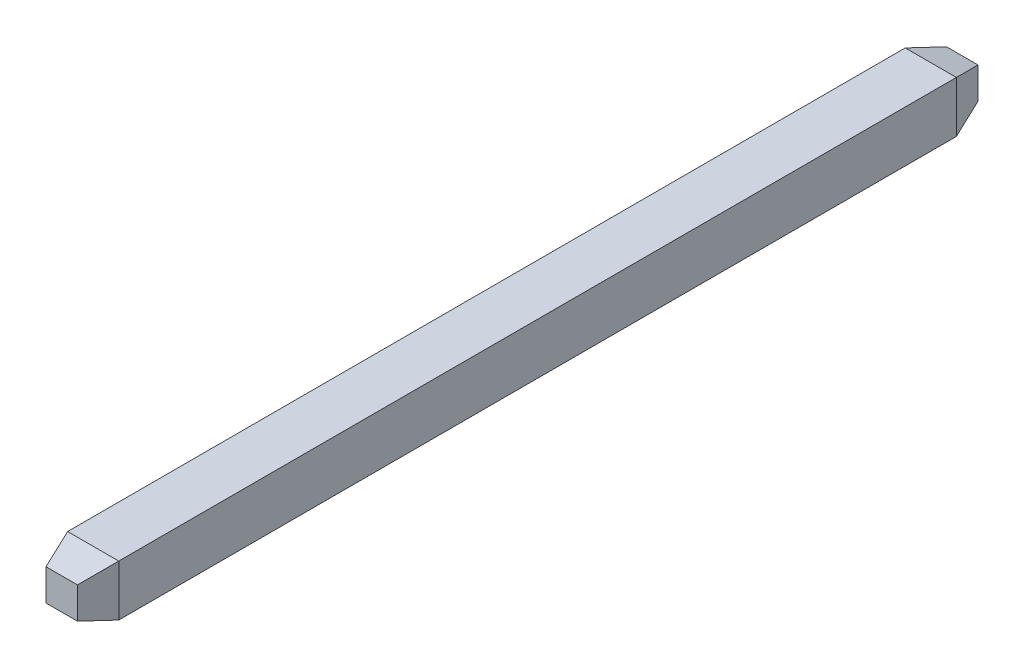
ISO-10303-21;
HEADER;
FILE_DESCRIPTION(('STEP AP214'),'2;1');
FILE_NAME('part.step','',(''),(''),'','','');
FILE_SCHEMA(('AUTOMOTIVE_DESIGN { 1 0 10303 214 1 1 1 1 }'));
ENDSEC;
DATA;
#1=APPLICATION_CONTEXT('core data for automotive mechanical design processes');
#2=APPLICATION_PROTOCOL_DEFINITION('international standard','automotive_design',2000,#1);
#3=PRODUCT_CONTEXT('',#1,'mechanical');
#4=PRODUCT('Part','Part','',(#3));
#5=PRODUCT_RELATED_PRODUCT_CATEGORY('part','',(#4));
#6=PRODUCT_DEFINITION_FORMATION('','',#4);
#7=PRODUCT_DEFINITION_CONTEXT('part definition',#1,'design');
#8=PRODUCT_DEFINITION('design','',#6,#7);
#9=PRODUCT_DEFINITION_SHAPE('','',#8);
#10=(LENGTH_UNIT() NAMED_UNIT(*) SI_UNIT(.MILLI.,.METRE.));
#11=(NAMED_UNIT(*) PLANE_ANGLE_UNIT() SI_UNIT($,.RADIAN.));
#12=(NAMED_UNIT(*) SI_UNIT($,.STERADIAN.) SOLID_ANGLE_UNIT());
#13=UNCERTAINTY_MEASURE_WITH_UNIT(LENGTH_MEASURE(1.E-05),#10,'distance_accuracy_value','');
#14=(GEOMETRIC_REPRESENTATION_CONTEXT(3) GLOBAL_UNCERTAINTY_ASSIGNED_CONTEXT((#13)) GLOBAL_UNIT_ASSIGNED_CONTEXT((#10,
#11,#12)) REPRESENTATION_CONTEXT('',''));
#15=CARTESIAN_POINT('',(0.,0.,0.));
#16=DIRECTION('',(0.,0.,1.));
#17=DIRECTION('',(1.,0.,0.));
#18=AXIS2_PLACEMENT_3D('',#15,#16,#17);
#19=CARTESIAN_POINT('',(0.325,-0.325,-5.45));
#20=DIRECTION('',(1.,0.,0.));
#21=DIRECTION('',(0.,0.,-1.));
#22=AXIS2_PLACEMENT_3D('',#19,#20,#21);
#23=PLANE('',#22);
#24=DIRECTION('',(0.,0.,1.));
#25=VECTOR('',#24,1.);
#26=CARTESIAN_POINT('',(0.325,-0.325,-5.45));
#27=LINE('',#26,#25);
#28=CARTESIAN_POINT('',(0.325,-0.325,-5.04999999999999));
#29=VERTEX_POINT('',#28);
#30=CARTESIAN_POINT('',(0.325,-0.325,5.6));
#31=VERTEX_POINT('',#30);
#32=EDGE_CURVE('E118',#29,#31,#27,.T.);
#33=ORIENTED_EDGE('',*,*,#32,.F.);
#34=DIRECTION('',(0.,1.,0.));
#35=VECTOR('',#34,1.);
#36=CARTESIAN_POINT('',(0.325,-0.325,-5.04999999999999));
#37=LINE('',#36,#35);
#38=CARTESIAN_POINT('',(0.325,0.325,-5.04999999999999));
#39=VERTEX_POINT('',#38);
#40=EDGE_CURVE('E11',#29,#39,#37,.T.);
#41=ORIENTED_EDGE('',*,*,#40,.T.);
#42=DIRECTION('',(0.,0.,1.));
#43=VECTOR('',#42,1.);
#44=CARTESIAN_POINT('',(0.325,0.325,-5.45));
#45=LINE('',#44,#43);
#46=CARTESIAN_POINT('',(0.325,0.325,5.6));
#47=VERTEX_POINT('',#46);
#48=EDGE_CURVE('E144',#39,#47,#45,.T.);
#49=ORIENTED_EDGE('',*,*,#48,.T.);
#50=DIRECTION('',(0.,-1.,0.));
#51=VECTOR('',#50,1.);
#52=CARTESIAN_POINT('',(0.325,-0.325,5.6));
#53=LINE('',#52,#51);
#54=EDGE_CURVE('E132',#47,#31,#53,.T.);
#55=ORIENTED_EDGE('',*,*,#54,.T.);
#56=EDGE_LOOP('',(#33,#41,#49,#55));
#57=FACE_BOUND('',#56,.T.);
#58=ADVANCED_FACE('F32',(#57),#23,.T.);
#59=CARTESIAN_POINT('',(-0.325,-0.325,-5.45));
#60=DIRECTION('',(0.,-1.,0.));
#61=DIRECTION('',(0.,0.,-1.));
#62=AXIS2_PLACEMENT_3D('',#59,#60,#61);
#63=PLANE('',#62);
#64=DIRECTION('',(0.,0.,1.));
#65=VECTOR('',#64,1.);
#66=CARTESIAN_POINT('',(-0.325,-0.325,-5.45));
#67=LINE('',#66,#65);
#68=CARTESIAN_POINT('',(-0.325,-0.325,-5.04999999999999));
#69=VERTEX_POINT('',#68);
#70=CARTESIAN_POINT('',(-0.325,-0.325,5.6));
#71=VERTEX_POINT('',#70);
#72=EDGE_CURVE('E187',#69,#71,#67,.T.);
#73=ORIENTED_EDGE('',*,*,#72,.F.);
#74=DIRECTION('',(1.,0.,0.));
#75=VECTOR('',#74,1.);
#76=CARTESIAN_POINT('',(-0.325,-0.325,-5.04999999999999));
#77=LINE('',#76,#75);
#78=EDGE_CURVE('E137',#69,#29,#77,.T.);
#79=ORIENTED_EDGE('',*,*,#78,.T.);
#80=ORIENTED_EDGE('',*,*,#32,.T.);
#81=DIRECTION('',(-1.,0.,0.));
#82=VECTOR('',#81,1.);
#83=CARTESIAN_POINT('',(-0.325,-0.325,5.6));
#84=LINE('',#83,#82);
#85=EDGE_CURVE('E135',#31,#71,#84,.T.);
#86=ORIENTED_EDGE('',*,*,#85,.T.);
#87=EDGE_LOOP('',(#73,#79,#80,#86));
#88=FACE_BOUND('',#87,.T.);
#89=ADVANCED_FACE('F186',(#88),#63,.T.);
#90=CARTESIAN_POINT('',(-0.325,-0.325,-5.45));
#91=DIRECTION('',(-1.,0.,0.));
#92=DIRECTION('',(0.,0.,1.));
#93=AXIS2_PLACEMENT_3D('',#90,#91,#92);
#94=PLANE('',#93);
#95=DIRECTION('',(0.,0.,1.));
#96=VECTOR('',#95,1.);
#97=CARTESIAN_POINT('',(-0.325,0.325,-5.45));
#98=LINE('',#97,#96);
#99=CARTESIAN_POINT('',(-0.325,0.325,-5.04999999999999));
#100=VERTEX_POINT('',#99);
#101=CARTESIAN_POINT('',(-0.325,0.325,5.6));
#102=VERTEX_POINT('',#101);
#103=EDGE_CURVE('E190',#100,#102,#98,.T.);
#104=ORIENTED_EDGE('',*,*,#103,.F.);
#105=DIRECTION('',(0.,-1.,0.));
#106=VECTOR('',#105,1.);
#107=CARTESIAN_POINT('',(-0.325,-0.325,-5.04999999999999));
#108=LINE('',#107,#106);
#109=EDGE_CURVE('E156',#100,#69,#108,.T.);
#110=ORIENTED_EDGE('',*,*,#109,.T.);
#111=ORIENTED_EDGE('',*,*,#72,.T.);
#112=DIRECTION('',(0.,1.,0.));
#113=VECTOR('',#112,1.);
#114=CARTESIAN_POINT('',(-0.325,0.325,5.6));
#115=LINE('',#114,#113);
#116=EDGE_CURVE('E105',#71,#102,#115,.T.);
#117=ORIENTED_EDGE('',*,*,#116,.T.);
#118=EDGE_LOOP('',(#104,#110,#111,#117));
#119=FACE_BOUND('',#118,.T.);
#120=ADVANCED_FACE('F201',(#119),#94,.T.);
#121=CARTESIAN_POINT('',(-0.325,0.325,-5.45));
#122=DIRECTION('',(0.,1.,0.));
#123=DIRECTION('',(0.,0.,1.));
#124=AXIS2_PLACEMENT_3D('',#121,#122,#123);
#125=PLANE('',#124);
#126=ORIENTED_EDGE('',*,*,#48,.F.);
#127=DIRECTION('',(-1.,0.,0.));
#128=VECTOR('',#127,1.);
#129=CARTESIAN_POINT('',(-0.325,0.325,-5.04999999999999));
#130=LINE('',#129,#128);
#131=EDGE_CURVE('E41',#39,#100,#130,.T.);
#132=ORIENTED_EDGE('',*,*,#131,.T.);
#133=ORIENTED_EDGE('',*,*,#103,.T.);
#134=DIRECTION('',(1.,0.,0.));
#135=VECTOR('',#134,1.);
#136=CARTESIAN_POINT('',(0.325,0.325,5.6));
#137=LINE('',#136,#135);
#138=EDGE_CURVE('E125',#102,#47,#137,.T.);
#139=ORIENTED_EDGE('',*,*,#138,.T.);
#140=EDGE_LOOP('',(#126,#132,#133,#139));
#141=FACE_BOUND('',#140,.T.);
#142=ADVANCED_FACE('F202',(#141),#125,.T.);
#143=CARTESIAN_POINT('',(0.,0.,-5.45));
#144=DIRECTION('',(0.,0.,-1.));
#145=DIRECTION('',(-1.,0.,0.));
#146=AXIS2_PLACEMENT_3D('',#143,#144,#145);
#147=PLANE('',#146);
#148=DIRECTION('',(0.,-1.,0.));
#149=VECTOR('',#148,1.);
#150=CARTESIAN_POINT('',(0.199999999999999,0.,-5.45));
#151=LINE('',#150,#149);
#152=CARTESIAN_POINT('',(0.199999999999999,0.199999999999999,-5.45));
#153=VERTEX_POINT('',#152);
#154=CARTESIAN_POINT('',(0.199999999999999,-0.199999999999999,-5.45));
#155=VERTEX_POINT('',#154);
#156=EDGE_CURVE('E147',#153,#155,#151,.T.);
#157=ORIENTED_EDGE('',*,*,#156,.T.);
#158=DIRECTION('',(-1.,0.,0.));
#159=VECTOR('',#158,1.);
#160=CARTESIAN_POINT('',(0.,-0.199999999999999,-5.45));
#161=LINE('',#160,#159);
#162=CARTESIAN_POINT('',(-0.199999999999999,-0.199999999999999,-5.45));
#163=VERTEX_POINT('',#162);
#164=EDGE_CURVE('E153',#155,#163,#161,.T.);
#165=ORIENTED_EDGE('',*,*,#164,.T.);
#166=DIRECTION('',(0.,1.,0.));
#167=VECTOR('',#166,1.);
#168=CARTESIAN_POINT('',(-0.199999999999999,0.,-5.45));
#169=LINE('',#168,#167);
#170=CARTESIAN_POINT('',(-0.199999999999999,0.199999999999999,-5.45));
#171=VERTEX_POINT('',#170);
#172=EDGE_CURVE('E151',#163,#171,#169,.T.);
#173=ORIENTED_EDGE('',*,*,#172,.T.);
#174=DIRECTION('',(1.,0.,0.));
#175=VECTOR('',#174,1.);
#176=CARTESIAN_POINT('',(0.,0.199999999999999,-5.45));
#177=LINE('',#176,#175);
#178=EDGE_CURVE('E149',#171,#153,#177,.T.);
#179=ORIENTED_EDGE('',*,*,#178,.T.);
#180=EDGE_LOOP('',(#157,#165,#173,#179));
#181=FACE_BOUND('',#180,.T.);
#182=ADVANCED_FACE('F177',(#181),#147,.T.);
#183=CARTESIAN_POINT('',(0.,0.,6.));
#184=DIRECTION('',(0.,0.,-1.));
#185=DIRECTION('',(-1.,0.,0.));
#186=AXIS2_PLACEMENT_3D('',#183,#184,#185);
#187=PLANE('',#186);
#188=DIRECTION('',(-1.,0.,0.));
#189=VECTOR('',#188,1.);
#190=CARTESIAN_POINT('',(-0.325,0.2,6.));
#191=LINE('',#190,#189);
#192=CARTESIAN_POINT('',(0.2,0.2,6.));
#193=VERTEX_POINT('',#192);
#194=CARTESIAN_POINT('',(-0.2,0.2,6.));
#195=VERTEX_POINT('',#194);
#196=EDGE_CURVE('E122',#193,#195,#191,.T.);
#197=ORIENTED_EDGE('',*,*,#196,.T.);
#198=DIRECTION('',(0.,-1.,0.));
#199=VECTOR('',#198,1.);
#200=CARTESIAN_POINT('',(-0.2,-0.325,6.));
#201=LINE('',#200,#199);
#202=CARTESIAN_POINT('',(-0.2,-0.2,6.));
#203=VERTEX_POINT('',#202);
#204=EDGE_CURVE('E103',#195,#203,#201,.T.);
#205=ORIENTED_EDGE('',*,*,#204,.T.);
#206=DIRECTION('',(1.,0.,0.));
#207=VECTOR('',#206,1.);
#208=CARTESIAN_POINT('',(0.325,-0.2,6.));
#209=LINE('',#208,#207);
#210=CARTESIAN_POINT('',(0.2,-0.2,6.));
#211=VERTEX_POINT('',#210);
#212=EDGE_CURVE('E111',#203,#211,#209,.T.);
#213=ORIENTED_EDGE('',*,*,#212,.T.);
#214=DIRECTION('',(0.,1.,0.));
#215=VECTOR('',#214,1.);
#216=CARTESIAN_POINT('',(0.2,0.325,6.));
#217=LINE('',#216,#215);
#218=EDGE_CURVE('E117',#211,#193,#217,.T.);
#219=ORIENTED_EDGE('',*,*,#218,.T.);
#220=EDGE_LOOP('',(#197,#205,#213,#219));
#221=FACE_BOUND('',#220,.T.);
#222=ADVANCED_FACE('F120',(#221),#187,.F.);
#223=CARTESIAN_POINT('',(0.2,0.,6.));
#224=DIRECTION('',(0.95447997803503,0.,0.298274993135945));
#225=DIRECTION('',(0.,-1.,0.));
#226=AXIS2_PLACEMENT_3D('',#223,#224,#225);
#227=PLANE('',#226);
#228=DIRECTION('',(-0.285830975237513,0.285830975237513,0.914659120760048));
#229=VECTOR('',#228,1.);
#230=CARTESIAN_POINT('',(0.183660130718954,-0.183660130718954,6.05228758169935));
#231=LINE('',#230,#229);
#232=EDGE_CURVE('E114',#31,#211,#231,.T.);
#233=ORIENTED_EDGE('',*,*,#232,.F.);
#234=ORIENTED_EDGE('',*,*,#54,.F.);
#235=DIRECTION('',(-0.285830975237513,-0.285830975237513,0.914659120760048));
#236=VECTOR('',#235,1.);
#237=CARTESIAN_POINT('',(0.183660130718954,0.183660130718954,6.05228758169935));
#238=LINE('',#237,#236);
#239=EDGE_CURVE('E141',#193,#47,#238,.F.);
#240=ORIENTED_EDGE('',*,*,#239,.F.);
#241=ORIENTED_EDGE('',*,*,#218,.F.);
#242=EDGE_LOOP('',(#233,#234,#240,#241));
#243=FACE_BOUND('',#242,.T.);
#244=ADVANCED_FACE('F196',(#243),#227,.T.);
#245=CARTESIAN_POINT('',(0.,0.2,6.));
#246=DIRECTION('',(0.,0.95447997803503,0.298274993135945));
#247=DIRECTION('',(1.,0.,0.));
#248=AXIS2_PLACEMENT_3D('',#245,#246,#247);
#249=PLANE('',#248);
#250=ORIENTED_EDGE('',*,*,#239,.T.);
#251=ORIENTED_EDGE('',*,*,#138,.F.);
#252=DIRECTION('',(0.285830975237513,-0.285830975237513,0.914659120760048));
#253=VECTOR('',#252,1.);
#254=CARTESIAN_POINT('',(-0.183660130718954,0.183660130718954,6.05228758169935));
#255=LINE('',#254,#253);
#256=EDGE_CURVE('E108',#195,#102,#255,.F.);
#257=ORIENTED_EDGE('',*,*,#256,.F.);
#258=ORIENTED_EDGE('',*,*,#196,.F.);
#259=EDGE_LOOP('',(#250,#251,#257,#258));
#260=FACE_BOUND('',#259,.T.);
#261=ADVANCED_FACE('F199',(#260),#249,.T.);
#262=CARTESIAN_POINT('',(0.,-0.2,6.));
#263=DIRECTION('',(0.,-0.95447997803503,0.298274993135945));
#264=DIRECTION('',(-1.,0.,0.));
#265=AXIS2_PLACEMENT_3D('',#262,#263,#264);
#266=PLANE('',#265);
#267=ORIENTED_EDGE('',*,*,#232,.T.);
#268=ORIENTED_EDGE('',*,*,#212,.F.);
#269=DIRECTION('',(-0.285830975237513,-0.285830975237513,-0.914659120760048));
#270=VECTOR('',#269,1.);
#271=CARTESIAN_POINT('',(-0.183660130718954,-0.183660130718954,6.05228758169935));
#272=LINE('',#271,#270);
#273=EDGE_CURVE('E98',#71,#203,#272,.F.);
#274=ORIENTED_EDGE('',*,*,#273,.F.);
#275=ORIENTED_EDGE('',*,*,#85,.F.);
#276=EDGE_LOOP('',(#267,#268,#274,#275));
#277=FACE_BOUND('',#276,.T.);
#278=ADVANCED_FACE('F112',(#277),#266,.T.);
#279=CARTESIAN_POINT('',(-0.2,0.,6.));
#280=DIRECTION('',(-0.95447997803503,0.,0.298274993135945));
#281=DIRECTION('',(0.,1.,0.));
#282=AXIS2_PLACEMENT_3D('',#279,#280,#281);
#283=PLANE('',#282);
#284=ORIENTED_EDGE('',*,*,#256,.T.);
#285=ORIENTED_EDGE('',*,*,#116,.F.);
#286=ORIENTED_EDGE('',*,*,#273,.T.);
#287=ORIENTED_EDGE('',*,*,#204,.F.);
#288=EDGE_LOOP('',(#284,#285,#286,#287));
#289=FACE_BOUND('',#288,.T.);
#290=ADVANCED_FACE('F101',(#289),#283,.T.);
#291=CARTESIAN_POINT('',(-0.325,0.325,-5.04999999999999));
#292=DIRECTION('',(0.,-0.95447997803503,0.298274993135945));
#293=DIRECTION('',(-1.,0.,0.));
#294=AXIS2_PLACEMENT_3D('',#291,#292,#293);
#295=PLANE('',#294);
#296=DIRECTION('',(0.285830975237513,0.285830975237513,0.914659120760048));
#297=VECTOR('',#296,1.);
#298=CARTESIAN_POINT('',(0.271895424836602,0.271895424836602,-5.21993464052287));
#299=LINE('',#298,#297);
#300=EDGE_CURVE('E162',#153,#39,#299,.T.);
#301=ORIENTED_EDGE('',*,*,#300,.F.);
#302=ORIENTED_EDGE('',*,*,#178,.F.);
#303=DIRECTION('',(-0.285830975237513,0.285830975237513,0.914659120760048));
#304=VECTOR('',#303,1.);
#305=CARTESIAN_POINT('',(-0.325,0.325,-5.04999999999999));
#306=LINE('',#305,#304);
#307=EDGE_CURVE('E36',#100,#171,#306,.F.);
#308=ORIENTED_EDGE('',*,*,#307,.F.);
#309=ORIENTED_EDGE('',*,*,#131,.F.);
#310=EDGE_LOOP('',(#301,#302,#308,#309));
#311=FACE_BOUND('',#310,.T.);
#312=ADVANCED_FACE('F34',(#311),#295,.F.);
#313=CARTESIAN_POINT('',(-0.325,-0.325,-5.04999999999999));
#314=DIRECTION('',(0.95447997803503,0.,0.298274993135945));
#315=DIRECTION('',(0.,-1.,0.));
#316=AXIS2_PLACEMENT_3D('',#313,#314,#315);
#317=PLANE('',#316);
#318=ORIENTED_EDGE('',*,*,#307,.T.);
#319=ORIENTED_EDGE('',*,*,#172,.F.);
#320=DIRECTION('',(-0.285830975237513,-0.285830975237513,0.914659120760048));
#321=VECTOR('',#320,1.);
#322=CARTESIAN_POINT('',(-0.325,-0.325,-5.04999999999999));
#323=LINE('',#322,#321);
#324=EDGE_CURVE('E161',#69,#163,#323,.F.);
#325=ORIENTED_EDGE('',*,*,#324,.F.);
#326=ORIENTED_EDGE('',*,*,#109,.F.);
#327=EDGE_LOOP('',(#318,#319,#325,#326));
#328=FACE_BOUND('',#327,.T.);
#329=ADVANCED_FACE('F172',(#328),#317,.F.);
#330=CARTESIAN_POINT('',(0.325,-0.325,-5.04999999999999));
#331=DIRECTION('',(-0.95447997803503,0.,0.298274993135945));
#332=DIRECTION('',(0.,1.,0.));
#333=AXIS2_PLACEMENT_3D('',#330,#331,#332);
#334=PLANE('',#333);
#335=ORIENTED_EDGE('',*,*,#300,.T.);
#336=ORIENTED_EDGE('',*,*,#40,.F.);
#337=DIRECTION('',(-0.285830975237513,0.285830975237513,-0.914659120760048));
#338=VECTOR('',#337,1.);
#339=CARTESIAN_POINT('',(0.325,-0.325,-5.04999999999999));
#340=LINE('',#339,#338);
#341=EDGE_CURVE('E159',#155,#29,#340,.F.);
#342=ORIENTED_EDGE('',*,*,#341,.F.);
#343=ORIENTED_EDGE('',*,*,#156,.F.);
#344=EDGE_LOOP('',(#335,#336,#342,#343));
#345=FACE_BOUND('',#344,.T.);
#346=ADVANCED_FACE('F183',(#345),#334,.F.);
#347=CARTESIAN_POINT('',(-0.325,-0.325,-5.04999999999999));
#348=DIRECTION('',(0.,0.95447997803503,0.298274993135945));
#349=DIRECTION('',(1.,0.,0.));
#350=AXIS2_PLACEMENT_3D('',#347,#348,#349);
#351=PLANE('',#350);
#352=ORIENTED_EDGE('',*,*,#324,.T.);
#353=ORIENTED_EDGE('',*,*,#164,.F.);
#354=ORIENTED_EDGE('',*,*,#341,.T.);
#355=ORIENTED_EDGE('',*,*,#78,.F.);
#356=EDGE_LOOP('',(#352,#353,#354,#355));
#357=FACE_BOUND('',#356,.T.);
#358=ADVANCED_FACE('F181',(#357),#351,.F.);
#359=CLOSED_SHELL('',(#58,#89,#120,#142,#182,#222,#244,#261,#278,#290,#312,#329,#346,#358));
#360=MANIFOLD_SOLID_BREP('B2',#359);
#361=ADVANCED_BREP_SHAPE_REPRESENTATION('',(#18,#360),#14);
#362=SHAPE_DEFINITION_REPRESENTATION(#9,#361);
ENDSEC;
END-ISO-10303-21;
